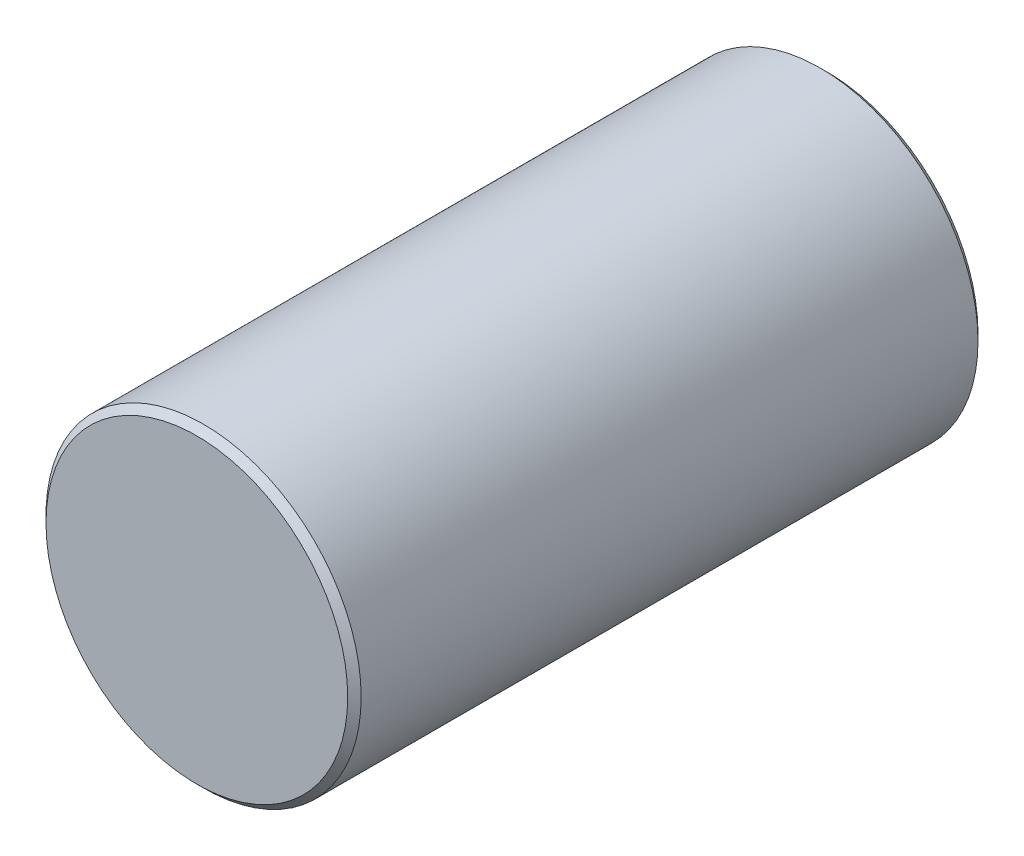
ISO-10303-21;
HEADER;
FILE_DESCRIPTION(('STEP AP214'),'2;1');
FILE_NAME('part.step','',(''),(''),'','','');
FILE_SCHEMA(('AUTOMOTIVE_DESIGN { 1 0 10303 214 1 1 1 1 }'));
ENDSEC;
DATA;
#1=APPLICATION_CONTEXT('core data for automotive mechanical design processes');
#2=APPLICATION_PROTOCOL_DEFINITION('international standard','automotive_design',2000,#1);
#3=PRODUCT_CONTEXT('',#1,'mechanical');
#4=PRODUCT('Part','Part','',(#3));
#5=PRODUCT_RELATED_PRODUCT_CATEGORY('part','',(#4));
#6=PRODUCT_DEFINITION_FORMATION('','',#4);
#7=PRODUCT_DEFINITION_CONTEXT('part definition',#1,'design');
#8=PRODUCT_DEFINITION('design','',#6,#7);
#9=PRODUCT_DEFINITION_SHAPE('','',#8);
#10=(LENGTH_UNIT() NAMED_UNIT(*) SI_UNIT(.MILLI.,.METRE.));
#11=(NAMED_UNIT(*) PLANE_ANGLE_UNIT() SI_UNIT($,.RADIAN.));
#12=(NAMED_UNIT(*) SI_UNIT($,.STERADIAN.) SOLID_ANGLE_UNIT());
#13=UNCERTAINTY_MEASURE_WITH_UNIT(LENGTH_MEASURE(1.E-05),#10,'distance_accuracy_value','');
#14=(GEOMETRIC_REPRESENTATION_CONTEXT(3) GLOBAL_UNCERTAINTY_ASSIGNED_CONTEXT((#13)) GLOBAL_UNIT_ASSIGNED_CONTEXT((#10,
#11,#12)) REPRESENTATION_CONTEXT('',''));
#15=CARTESIAN_POINT('',(0.,0.,0.));
#16=DIRECTION('',(0.,0.,1.));
#17=DIRECTION('',(1.,0.,0.));
#18=AXIS2_PLACEMENT_3D('',#15,#16,#17);
#19=CARTESIAN_POINT('',(0.,0.,19.05));
#20=DIRECTION('',(0.,0.,-1.));
#21=DIRECTION('',(-1.,0.,0.));
#22=AXIS2_PLACEMENT_3D('',#19,#20,#21);
#23=CYLINDRICAL_SURFACE('',#22,9.525);
#24=CARTESIAN_POINT('',(0.,0.,-18.6435999999999));
#25=DIRECTION('',(0.,0.,1.));
#26=DIRECTION('',(1.,0.,0.));
#27=AXIS2_PLACEMENT_3D('',#24,#25,#26);
#28=CIRCLE('',#27,9.525);
#29=CARTESIAN_POINT('',(9.525,0.,-18.6435999999999));
#30=VERTEX_POINT('',#29);
#31=EDGE_CURVE('E83',#30,#30,#28,.T.);
#32=ORIENTED_EDGE('',*,*,#31,.T.);
#33=EDGE_LOOP('',(#32));
#34=FACE_BOUND('',#33,.T.);
#35=CARTESIAN_POINT('',(0.,0.,18.6436));
#36=DIRECTION('',(0.,0.,1.));
#37=DIRECTION('',(1.,0.,0.));
#38=AXIS2_PLACEMENT_3D('',#35,#36,#37);
#39=CIRCLE('',#38,9.525);
#40=CARTESIAN_POINT('',(9.525,0.,18.6436));
#41=VERTEX_POINT('',#40);
#42=EDGE_CURVE('E87',#41,#41,#39,.F.);
#43=ORIENTED_EDGE('',*,*,#42,.T.);
#44=EDGE_LOOP('',(#43));
#45=FACE_BOUND('',#44,.T.);
#46=CARTESIAN_POINT('',(0.,-9.525,11.1125));
#47=CARTESIAN_POINT('',(0.0885132246484664,-9.52499848342203,11.1125035489819));
#48=CARTESIAN_POINT('',(0.177074754967651,-9.52375335474776,11.1199277696053));
#49=CARTESIAN_POINT('',(0.351713940762382,-9.51890619037781,11.149416143316));
#50=CARTESIAN_POINT('',(0.437789236154122,-9.5153019874167,11.1714937586389));
#51=CARTESIAN_POINT('',(0.604904014480029,-9.50614093330146,11.2296038098564));
#52=CARTESIAN_POINT('',(0.685947553954256,-9.50058567976088,11.2656248306818));
#53=CARTESIAN_POINT('',(0.840830069655994,-9.48813334197115,11.3505693054533));
#54=CARTESIAN_POINT('',(0.914669868572904,-9.48123641121565,11.3994912837017));
#55=CARTESIAN_POINT('',(1.05376511007522,-9.46679156586028,11.509346478226));
#56=CARTESIAN_POINT('',(1.1189416937447,-9.45923858602434,11.5703788877939));
#57=CARTESIAN_POINT('',(1.23817919664905,-9.44437168066725,11.7025089599802));
#58=CARTESIAN_POINT('',(1.29223941411327,-9.43705777026294,11.7736072575749));
#59=CARTESIAN_POINT('',(1.38802562475926,-9.42344804257461,11.9243925635351));
#60=CARTESIAN_POINT('',(1.42967364106673,-9.41715876973189,12.004129748871));
#61=CARTESIAN_POINT('',(1.49895456203612,-9.40638066519618,12.1695905733309));
#62=CARTESIAN_POINT('',(1.52658841339416,-9.40189171189085,12.2553138076353));
#63=CARTESIAN_POINT('',(1.56680812989335,-9.3952729089515,12.4294774745339));
#64=CARTESIAN_POINT('',(1.57953013350098,-9.39312172988419,12.5178856426784));
#65=CARTESIAN_POINT('',(1.58998712055907,-9.39135751224772,12.695605975821));
#66=CARTESIAN_POINT('',(1.58772316464701,-9.39174429405331,12.7849180763962));
#67=CARTESIAN_POINT('',(1.56838338748155,-9.39499282328357,12.9609391919099));
#68=CARTESIAN_POINT('',(1.5514605,-9.39782901557512,13.0476655502512));
#69=CARTESIAN_POINT('',(1.50352324415618,-9.4056167945899,13.2170305368215));
#70=CARTESIAN_POINT('',(1.47250839249303,-9.41056845386527,13.2996690247442));
#71=CARTESIAN_POINT('',(1.39711255126963,-9.42205684377153,13.458970302885));
#72=CARTESIAN_POINT('',(1.35266805531361,-9.42860107613152,13.5356024728616));
#73=CARTESIAN_POINT('',(1.25171963114896,-9.44253203193531,13.6803792943419));
#74=CARTESIAN_POINT('',(1.19521472961547,-9.44991882335472,13.7485232601089));
#75=CARTESIAN_POINT('',(1.07091620472099,-9.46481487703664,13.8752745644877));
#76=CARTESIAN_POINT('',(1.00299136705943,-9.47232452262099,13.933753259273));
#77=CARTESIAN_POINT('',(0.858224883103339,-9.48653551886919,14.0385023792925));
#78=CARTESIAN_POINT('',(0.781383179360572,-9.49323686432489,14.0847727258664));
#79=CARTESIAN_POINT('',(0.620843256765855,-9.50508571986999,14.1638034142315));
#80=CARTESIAN_POINT('',(0.537139340733553,-9.51023192188729,14.1965523912753));
#81=CARTESIAN_POINT('',(0.365314449457728,-9.51838014413039,14.2474913266812));
#82=CARTESIAN_POINT('',(0.277193844378955,-9.52138234372551,14.2656825029783));
#83=CARTESIAN_POINT('',(0.100145787326524,-9.52488017450106,14.2868150626228));
#84=CARTESIAN_POINT('',(0.0112399680908856,-9.52540483163118,14.2899330480966));
#85=CARTESIAN_POINT('',(-0.165823755785085,-9.52396796257443,14.2813015462881));
#86=CARTESIAN_POINT('',(-0.253981689071451,-9.52200653204815,14.2695526310601));
#87=CARTESIAN_POINT('',(-0.426501671472201,-9.51583585105758,14.231667720672));
#88=CARTESIAN_POINT('',(-0.510883451424722,-9.51164026548832,14.2056191576723));
#89=CARTESIAN_POINT('',(-0.674082271886387,-9.50146984929153,14.1399675809433));
#90=CARTESIAN_POINT('',(-0.752898999602677,-9.49549491875132,14.1003638060516));
#91=CARTESIAN_POINT('',(-0.903497487812794,-9.48235667852029,14.0083215358175));
#92=CARTESIAN_POINT('',(-0.975210934345094,-9.47518333488259,13.9557727258338));
#93=CARTESIAN_POINT('',(-1.10886467679421,-9.46047426793857,13.8394838047305));
#94=CARTESIAN_POINT('',(-1.17080426220733,-9.45293851833932,13.7757428807193));
#95=CARTESIAN_POINT('',(-1.28380666508284,-9.43826011274762,13.6380870569746));
#96=CARTESIAN_POINT('',(-1.33475016330721,-9.43112233747062,13.5640736048983));
#97=CARTESIAN_POINT('',(-1.42348096703732,-9.41813921408956,13.408435864597));
#98=CARTESIAN_POINT('',(-1.46126868957884,-9.41229382501923,13.3268118177305));
#99=CARTESIAN_POINT('',(-1.52243684048545,-9.40259393098042,13.1586035196643));
#100=CARTESIAN_POINT('',(-1.54587665966795,-9.39873122987526,13.0720413596556));
#101=CARTESIAN_POINT('',(-1.57787051314921,-9.39341350190391,12.8961387179442));
#102=CARTESIAN_POINT('',(-1.58642584158582,-9.39195826572028,12.8067984784701));
#103=CARTESIAN_POINT('',(-1.58837176994007,-9.39162925508347,12.6290672196139));
#104=CARTESIAN_POINT('',(-1.5819501864395,-9.39272350881088,12.5406782596047));
#105=CARTESIAN_POINT('',(-1.5545306977376,-9.39730011223118,12.3662571774878));
#106=CARTESIAN_POINT('',(-1.53353283978143,-9.40078245418371,12.2802250477419));
#107=CARTESIAN_POINT('',(-1.47762880089276,-9.40973071238891,12.1130323923192));
#108=CARTESIAN_POINT('',(-1.44273879003128,-9.4151943218449,12.0318663286144));
#109=CARTESIAN_POINT('',(-1.3600601474866,-9.42749174265602,11.8765093500613));
#110=CARTESIAN_POINT('',(-1.31227087605534,-9.43432562196633,11.8023187814137));
#111=CARTESIAN_POINT('',(-1.20447999157632,-9.4486949331897,11.6620699047266));
#112=CARTESIAN_POINT('',(-1.14434020788197,-9.45623772690952,11.5961185293953));
#113=CARTESIAN_POINT('',(-1.01384673492645,-9.47111626449134,11.4751792311584));
#114=CARTESIAN_POINT('',(-0.943490691699525,-9.47845196016857,11.4201938419148));
#115=CARTESIAN_POINT('',(-0.793984422721579,-9.4921484632281,11.322400349693));
#116=CARTESIAN_POINT('',(-0.71477682008334,-9.49850218820721,11.2796789650363));
#117=CARTESIAN_POINT('',(-0.550235799055653,-9.50944991427127,11.2082138772727));
#118=CARTESIAN_POINT('',(-0.464908579217056,-9.51404566692701,11.1794562535144));
#119=CARTESIAN_POINT('',(-0.31604160187883,-9.51995677178927,11.1429766509296));
#120=CARTESIAN_POINT('',(-0.253402357239514,-9.52183787318583,11.1315662117939));
#121=CARTESIAN_POINT('',(-0.127183712053079,-9.52436002151187,11.1163266764686));
#122=CARTESIAN_POINT('',(-0.0636043277113938,-9.52500108979107,11.1124974497528));
#123=CARTESIAN_POINT('',(0.,-9.525,11.1125));
#124=B_SPLINE_CURVE_WITH_KNOTS('',3,(#46,#47,#48,#49,#50,#51,#52,#53,#54,#55,#56,#57,#58,#59,
#60,#61,#62,#63,#64,#65,#66,#67,#68,#69,#70,#71,#72,#73,#74,#75,#76,#77,#78,#79,#80,#81,#82,#83,
#84,#85,#86,#87,#88,#89,#90,#91,#92,#93,#94,#95,#96,#97,#98,#99,#100,#101,#102,#103,#104,#105,
#106,#107,#108,#109,#110,#111,#112,#113,#114,#115,#116,#117,#118,#119,#120,#121,#122,#123),
.UNSPECIFIED.,.T.,.F.,(4,2,2,2,2,2,2,2,2,2,2,2,2,2,2,2,2,2,2,2,2,2,2,2,2,2,2,2,2,2,2,2,2,2,2,2,
2,2,4),(0.,0.265307181435953,0.530858441516592,0.796192760561046,1.06149674204849,
1.32907081824581,1.59666178107859,1.86590000723138,2.13512004316375,2.40186258960674,
2.66858625743763,2.93256031317859,3.19654342291117,3.46179493461674,3.72706786132164,
3.99562808893692,4.26419004688763,4.53297727461598,4.80174201270929,5.06735006017037,
5.33294788777771,5.59693957449074,5.86094608749552,6.1272853427316,6.39364395039469,
6.66276176974838,6.93187105733724,7.19985874187025,7.46782312494502,7.73244522546914,
7.99706646829464,8.26138059573651,8.52570783443628,8.79317128962804,9.06069647013147,
9.33006917070572,9.59917277602595,9.78982197584151,9.98046789320874),.UNSPECIFIED.);
#125=CARTESIAN_POINT('',(0.,-9.525,11.1125));
#126=VERTEX_POINT('',#125);
#127=EDGE_CURVE('E41',#126,#126,#124,.T.);
#128=ORIENTED_EDGE('',*,*,#127,.F.);
#129=EDGE_LOOP('',(#128));
#130=FACE_BOUND('',#129,.T.);
#131=CARTESIAN_POINT('',(0.,-9.525,-14.2875));
#132=CARTESIAN_POINT('',(0.0885132246484664,-9.52499848342203,-14.2874964510181));
#133=CARTESIAN_POINT('',(0.177074754967651,-9.52375335474776,-14.2800722303947));
#134=CARTESIAN_POINT('',(0.351713940762382,-9.51890619037781,-14.250583856684));
#135=CARTESIAN_POINT('',(0.437789236154122,-9.5153019874167,-14.2285062413611));
#136=CARTESIAN_POINT('',(0.604904014480029,-9.50614093330146,-14.1703961901436));
#137=CARTESIAN_POINT('',(0.685947553954257,-9.50058567976088,-14.1343751693182));
#138=CARTESIAN_POINT('',(0.840830069655994,-9.48813334197115,-14.0494306945467));
#139=CARTESIAN_POINT('',(0.914669868572904,-9.48123641121565,-14.0005087162983));
#140=CARTESIAN_POINT('',(1.05376511007522,-9.46679156586028,-13.890653521774));
#141=CARTESIAN_POINT('',(1.1189416937447,-9.45923858602434,-13.8296211122061));
#142=CARTESIAN_POINT('',(1.23817919664905,-9.44437168066725,-13.6974910400198));
#143=CARTESIAN_POINT('',(1.29223941411327,-9.43705777026294,-13.6263927424251));
#144=CARTESIAN_POINT('',(1.38802562475926,-9.42344804257461,-13.4756074364649));
#145=CARTESIAN_POINT('',(1.42967364106673,-9.41715876973189,-13.395870251129));
#146=CARTESIAN_POINT('',(1.49895456203612,-9.40638066519618,-13.2304094266691));
#147=CARTESIAN_POINT('',(1.52658841339416,-9.40189171189085,-13.1446861923647));
#148=CARTESIAN_POINT('',(1.56680812989335,-9.3952729089515,-12.9705225254661));
#149=CARTESIAN_POINT('',(1.57953013350098,-9.39312172988419,-12.8821143573216));
#150=CARTESIAN_POINT('',(1.58998712055907,-9.39135751224772,-12.704394024179));
#151=CARTESIAN_POINT('',(1.58772316464701,-9.39174429405331,-12.6150819236038));
#152=CARTESIAN_POINT('',(1.56838338748155,-9.39499282328357,-12.4390608080901));
#153=CARTESIAN_POINT('',(1.5514605,-9.39782901557512,-12.3523344497488));
#154=CARTESIAN_POINT('',(1.50352324415618,-9.4056167945899,-12.1829694631785));
#155=CARTESIAN_POINT('',(1.47250839249303,-9.41056845386527,-12.1003309752558));
#156=CARTESIAN_POINT('',(1.39711255126963,-9.42205684377153,-11.941029697115));
#157=CARTESIAN_POINT('',(1.35266805531361,-9.42860107613152,-11.8643975271384));
#158=CARTESIAN_POINT('',(1.25171963114896,-9.44253203193531,-11.7196207056581));
#159=CARTESIAN_POINT('',(1.19521472961547,-9.44991882335472,-11.6514767398911));
#160=CARTESIAN_POINT('',(1.07091620472099,-9.46481487703664,-11.5247254355123));
#161=CARTESIAN_POINT('',(1.00299136705943,-9.47232452262099,-11.466246740727));
#162=CARTESIAN_POINT('',(0.858224883103339,-9.48653551886919,-11.3614976207075));
#163=CARTESIAN_POINT('',(0.781383179360572,-9.49323686432489,-11.3152272741336));
#164=CARTESIAN_POINT('',(0.620843256765855,-9.50508571986999,-11.2361965857685));
#165=CARTESIAN_POINT('',(0.537139340733553,-9.51023192188729,-11.2034476087246));
#166=CARTESIAN_POINT('',(0.365314449457727,-9.51838014413039,-11.1525086733188));
#167=CARTESIAN_POINT('',(0.277193844378955,-9.52138234372551,-11.1343174970217));
#168=CARTESIAN_POINT('',(0.100145787326524,-9.52488017450106,-11.1131849373772));
#169=CARTESIAN_POINT('',(0.0112399680908856,-9.52540483163118,-11.1100669519034));
#170=CARTESIAN_POINT('',(-0.165823755785085,-9.52396796257443,-11.1186984537119));
#171=CARTESIAN_POINT('',(-0.253981689071451,-9.52200653204815,-11.1304473689399));
#172=CARTESIAN_POINT('',(-0.4265016714722,-9.51583585105758,-11.168332279328));
#173=CARTESIAN_POINT('',(-0.510883451424721,-9.51164026548832,-11.1943808423277));
#174=CARTESIAN_POINT('',(-0.674082271886386,-9.50146984929153,-11.2600324190567));
#175=CARTESIAN_POINT('',(-0.752898999602677,-9.49549491875132,-11.2996361939484));
#176=CARTESIAN_POINT('',(-0.903497487812794,-9.48235667852029,-11.3916784641825));
#177=CARTESIAN_POINT('',(-0.975210934345094,-9.47518333488259,-11.4442272741662));
#178=CARTESIAN_POINT('',(-1.10886467679421,-9.46047426793857,-11.5605161952695));
#179=CARTESIAN_POINT('',(-1.17080426220733,-9.45293851833932,-11.6242571192807));
#180=CARTESIAN_POINT('',(-1.28380666508284,-9.43826011274762,-11.7619129430254));
#181=CARTESIAN_POINT('',(-1.33475016330721,-9.43112233747062,-11.8359263951017));
#182=CARTESIAN_POINT('',(-1.42348096703732,-9.41813921408956,-11.991564135403));
#183=CARTESIAN_POINT('',(-1.46126868957884,-9.41229382501923,-12.0731881822695));
#184=CARTESIAN_POINT('',(-1.52243684048545,-9.40259393098042,-12.2413964803357));
#185=CARTESIAN_POINT('',(-1.54587665966795,-9.39873122987526,-12.3279586403444));
#186=CARTESIAN_POINT('',(-1.57787051314921,-9.39341350190391,-12.5038612820558));
#187=CARTESIAN_POINT('',(-1.58642584158582,-9.39195826572028,-12.5932015215299));
#188=CARTESIAN_POINT('',(-1.58837176994007,-9.39162925508347,-12.7709327803861));
#189=CARTESIAN_POINT('',(-1.5819501864395,-9.39272350881088,-12.8593217403953));
#190=CARTESIAN_POINT('',(-1.5545306977376,-9.39730011223118,-13.0337428225122));
#191=CARTESIAN_POINT('',(-1.53353283978143,-9.40078245418371,-13.1197749522581));
#192=CARTESIAN_POINT('',(-1.47762880089276,-9.40973071238891,-13.2869676076808));
#193=CARTESIAN_POINT('',(-1.44273879003128,-9.4151943218449,-13.3681336713856));
#194=CARTESIAN_POINT('',(-1.3600601474866,-9.42749174265602,-13.5234906499387));
#195=CARTESIAN_POINT('',(-1.31227087605534,-9.43432562196633,-13.5976812185863));
#196=CARTESIAN_POINT('',(-1.20447999157632,-9.4486949331897,-13.7379300952734));
#197=CARTESIAN_POINT('',(-1.14434020788197,-9.45623772690952,-13.8038814706047));
#198=CARTESIAN_POINT('',(-1.01384673492645,-9.47111626449134,-13.9248207688416));
#199=CARTESIAN_POINT('',(-0.943490691699524,-9.47845196016857,-13.9798061580852));
#200=CARTESIAN_POINT('',(-0.793984422721579,-9.4921484632281,-14.077599650307));
#201=CARTESIAN_POINT('',(-0.714776820083341,-9.49850218820721,-14.1203210349637));
#202=CARTESIAN_POINT('',(-0.550235799055655,-9.50944991427127,-14.1917861227273));
#203=CARTESIAN_POINT('',(-0.464908579217058,-9.51404566692701,-14.2205437464856));
#204=CARTESIAN_POINT('',(-0.31604160187883,-9.51995677178927,-14.2570233490704));
#205=CARTESIAN_POINT('',(-0.253402357239514,-9.52183787318583,-14.2684337882061));
#206=CARTESIAN_POINT('',(-0.127183712053079,-9.52436002151187,-14.2836733235314));
#207=CARTESIAN_POINT('',(-0.0636043277113937,-9.52500108979107,-14.2875025502472));
#208=CARTESIAN_POINT('',(0.,-9.525,-14.2875));
#209=B_SPLINE_CURVE_WITH_KNOTS('',3,(#131,#132,#133,#134,#135,#136,#137,#138,#139,#140,#141,
#142,#143,#144,#145,#146,#147,#148,#149,#150,#151,#152,#153,#154,#155,#156,#157,#158,#159,#160,
#161,#162,#163,#164,#165,#166,#167,#168,#169,#170,#171,#172,#173,#174,#175,#176,#177,#178,#179,
#180,#181,#182,#183,#184,#185,#186,#187,#188,#189,#190,#191,#192,#193,#194,#195,#196,#197,#198,
#199,#200,#201,#202,#203,#204,#205,#206,#207,#208),.UNSPECIFIED.,.T.,.F.,(4,2,2,2,2,2,2,2,2,2,2,
2,2,2,2,2,2,2,2,2,2,2,2,2,2,2,2,2,2,2,2,2,2,2,2,2,2,2,4),(0.,0.265307181435953,
0.530858441516592,0.796192760561047,1.06149674204849,1.32907081824581,1.59666178107859,
1.86590000723138,2.13512004316375,2.40186258960674,2.66858625743763,2.93256031317859,
3.19654342291117,3.46179493461674,3.72706786132164,3.99562808893692,4.26419004688763,
4.53297727461599,4.80174201270929,5.06735006017037,5.33294788777771,5.59693957449074,
5.86094608749552,6.1272853427316,6.39364395039469,6.66276176974838,6.93187105733724,
7.19985874187025,7.46782312494502,7.73244522546914,7.99706646829464,8.26138059573651,
8.52570783443628,8.79317128962804,9.06069647013148,9.33006917070572,9.59917277602596,
9.78982197584152,9.98046789320875),.UNSPECIFIED.);
#210=CARTESIAN_POINT('',(0.,-9.525,-14.2875));
#211=VERTEX_POINT('',#210);
#212=EDGE_CURVE('E10',#211,#211,#209,.T.);
#213=ORIENTED_EDGE('',*,*,#212,.F.);
#214=EDGE_LOOP('',(#213));
#215=FACE_BOUND('',#214,.T.);
#216=ADVANCED_FACE('F30',(#34,#45,#130,#215),#23,.T.);
#217=CARTESIAN_POINT('',(0.,0.,19.05));
#218=DIRECTION('',(0.,0.,1.));
#219=DIRECTION('',(1.,0.,0.));
#220=AXIS2_PLACEMENT_3D('',#217,#218,#219);
#221=PLANE('',#220);
#222=CARTESIAN_POINT('',(0.,0.,19.05));
#223=DIRECTION('',(0.,0.,1.));
#224=DIRECTION('',(1.,0.,0.));
#225=AXIS2_PLACEMENT_3D('',#222,#223,#224);
#226=CIRCLE('',#225,9.11860000000003);
#227=CARTESIAN_POINT('',(9.11860000000003,0.,19.05));
#228=VERTEX_POINT('',#227);
#229=EDGE_CURVE('E45',#228,#228,#226,.T.);
#230=ORIENTED_EDGE('',*,*,#229,.T.);
#231=EDGE_LOOP('',(#230));
#232=FACE_BOUND('',#231,.T.);
#233=ADVANCED_FACE('F64',(#232),#221,.T.);
#234=CARTESIAN_POINT('',(0.,0.,-19.05));
#235=DIRECTION('',(0.,0.,1.));
#236=DIRECTION('',(1.,0.,0.));
#237=AXIS2_PLACEMENT_3D('',#234,#235,#236);
#238=PLANE('',#237);
#239=CARTESIAN_POINT('',(0.,0.,-19.05));
#240=DIRECTION('',(0.,0.,1.));
#241=DIRECTION('',(1.,0.,0.));
#242=AXIS2_PLACEMENT_3D('',#239,#240,#241);
#243=CIRCLE('',#242,9.11859999999995);
#244=CARTESIAN_POINT('',(9.11859999999995,0.,-19.05));
#245=VERTEX_POINT('',#244);
#246=EDGE_CURVE('E49',#245,#245,#243,.F.);
#247=ORIENTED_EDGE('',*,*,#246,.T.);
#248=EDGE_LOOP('',(#247));
#249=FACE_BOUND('',#248,.T.);
#250=ADVANCED_FACE('F66',(#249),#238,.F.);
#251=CARTESIAN_POINT('',(0.,0.,-18.6435999999999));
#252=DIRECTION('',(0.,0.,1.));
#253=DIRECTION('',(1.,0.,0.));
#254=AXIS2_PLACEMENT_3D('',#251,#252,#253);
#255=CONICAL_SURFACE('',#254,9.525,0.78539816339744);
#256=ORIENTED_EDGE('',*,*,#246,.F.);
#257=EDGE_LOOP('',(#256));
#258=FACE_BOUND('',#257,.T.);
#259=ORIENTED_EDGE('',*,*,#31,.F.);
#260=EDGE_LOOP('',(#259));
#261=FACE_BOUND('',#260,.T.);
#262=ADVANCED_FACE('F69',(#258,#261),#255,.T.);
#263=CARTESIAN_POINT('',(0.,0.,19.05));
#264=DIRECTION('',(0.,0.,-1.));
#265=DIRECTION('',(-1.,0.,0.));
#266=AXIS2_PLACEMENT_3D('',#263,#264,#265);
#267=CONICAL_SURFACE('',#266,9.11860000000003,0.785398163397448);
#268=ORIENTED_EDGE('',*,*,#42,.F.);
#269=EDGE_LOOP('',(#268));
#270=FACE_BOUND('',#269,.T.);
#271=ORIENTED_EDGE('',*,*,#229,.F.);
#272=EDGE_LOOP('',(#271));
#273=FACE_BOUND('',#272,.T.);
#274=ADVANCED_FACE('F32',(#270,#273),#267,.T.);
#275=CARTESIAN_POINT('',(0.,-1.905,12.7));
#276=DIRECTION('',(0.,-1.,0.));
#277=DIRECTION('',(0.,0.,-1.));
#278=AXIS2_PLACEMENT_3D('',#275,#276,#277);
#279=CYLINDRICAL_SURFACE('',#278,1.5875);
#280=CARTESIAN_POINT('',(0.,-1.905,12.7));
#281=DIRECTION('',(0.,1.,0.));
#282=DIRECTION('',(0.,0.,1.));
#283=AXIS2_PLACEMENT_3D('',#280,#281,#282);
#284=CIRCLE('',#283,1.5875);
#285=CARTESIAN_POINT('',(0.,-1.905,14.2875));
#286=VERTEX_POINT('',#285);
#287=EDGE_CURVE('E90',#286,#286,#284,.T.);
#288=ORIENTED_EDGE('',*,*,#287,.T.);
#289=EDGE_LOOP('',(#288));
#290=FACE_BOUND('',#289,.T.);
#291=ORIENTED_EDGE('',*,*,#127,.T.);
#292=EDGE_LOOP('',(#291));
#293=FACE_BOUND('',#292,.T.);
#294=ADVANCED_FACE('F57',(#290,#293),#279,.F.);
#295=CARTESIAN_POINT('',(0.,-1.905,12.7));
#296=DIRECTION('',(0.,1.,0.));
#297=DIRECTION('',(0.,0.,1.));
#298=AXIS2_PLACEMENT_3D('',#295,#296,#297);
#299=PLANE('',#298);
#300=ORIENTED_EDGE('',*,*,#287,.F.);
#301=EDGE_LOOP('',(#300));
#302=FACE_BOUND('',#301,.T.);
#303=ADVANCED_FACE('F62',(#302),#299,.F.);
#304=CARTESIAN_POINT('',(0.,-1.905,-12.7));
#305=DIRECTION('',(0.,-1.,0.));
#306=DIRECTION('',(0.,0.,-1.));
#307=AXIS2_PLACEMENT_3D('',#304,#305,#306);
#308=CYLINDRICAL_SURFACE('',#307,1.5875);
#309=CARTESIAN_POINT('',(0.,-1.905,-12.7));
#310=DIRECTION('',(0.,1.,0.));
#311=DIRECTION('',(0.,0.,1.));
#312=AXIS2_PLACEMENT_3D('',#309,#310,#311);
#313=CIRCLE('',#312,1.5875);
#314=CARTESIAN_POINT('',(0.,-1.905,-11.1125));
#315=VERTEX_POINT('',#314);
#316=EDGE_CURVE('E94',#315,#315,#313,.T.);
#317=ORIENTED_EDGE('',*,*,#316,.T.);
#318=EDGE_LOOP('',(#317));
#319=FACE_BOUND('',#318,.T.);
#320=ORIENTED_EDGE('',*,*,#212,.T.);
#321=EDGE_LOOP('',(#320));
#322=FACE_BOUND('',#321,.T.);
#323=ADVANCED_FACE('F102',(#319,#322),#308,.F.);
#324=CARTESIAN_POINT('',(0.,-1.905,-12.7));
#325=DIRECTION('',(0.,1.,0.));
#326=DIRECTION('',(0.,0.,1.));
#327=AXIS2_PLACEMENT_3D('',#324,#325,#326);
#328=PLANE('',#327);
#329=ORIENTED_EDGE('',*,*,#316,.F.);
#330=EDGE_LOOP('',(#329));
#331=FACE_BOUND('',#330,.T.);
#332=ADVANCED_FACE('F104',(#331),#328,.F.);
#333=CLOSED_SHELL('',(#216,#233,#250,#262,#274,#294,#303,#323,#332));
#334=MANIFOLD_SOLID_BREP('B2',#333);
#335=ADVANCED_BREP_SHAPE_REPRESENTATION('',(#18,#334),#14);
#336=SHAPE_DEFINITION_REPRESENTATION(#9,#335);
ENDSEC;
END-ISO-10303-21;
